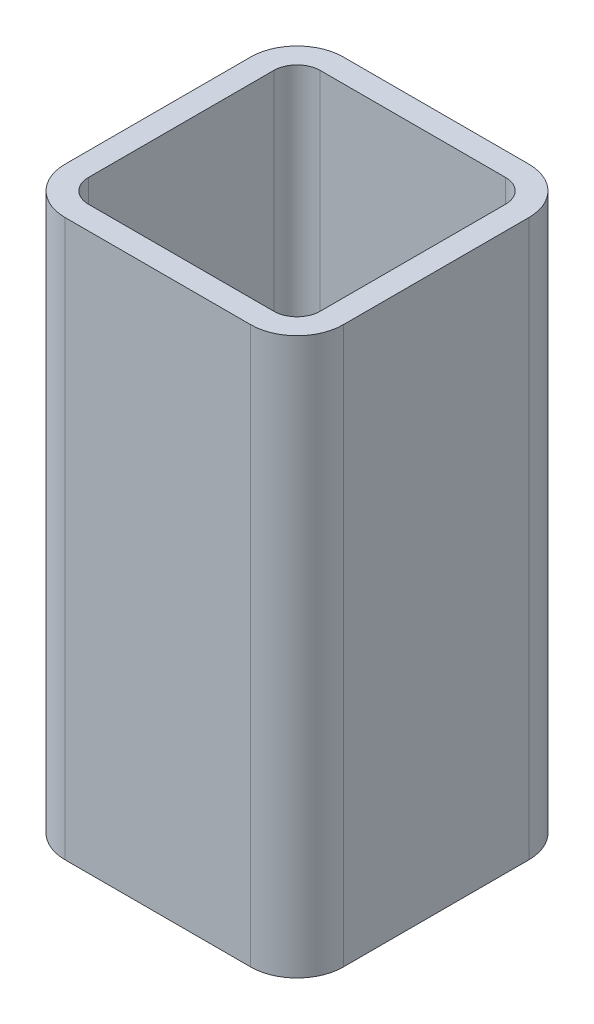
ISO-10303-21;
HEADER;
FILE_DESCRIPTION(('STEP AP214'),'2;1');
FILE_NAME('part.step','',(''),(''),'','','');
FILE_SCHEMA(('AUTOMOTIVE_DESIGN { 1 0 10303 214 1 1 1 1 }'));
ENDSEC;
DATA;
#1=APPLICATION_CONTEXT('core data for automotive mechanical design processes');
#2=APPLICATION_PROTOCOL_DEFINITION('international standard','automotive_design',2000,#1);
#3=PRODUCT_CONTEXT('',#1,'mechanical');
#4=PRODUCT('Part','Part','',(#3));
#5=PRODUCT_RELATED_PRODUCT_CATEGORY('part','',(#4));
#6=PRODUCT_DEFINITION_FORMATION('','',#4);
#7=PRODUCT_DEFINITION_CONTEXT('part definition',#1,'design');
#8=PRODUCT_DEFINITION('design','',#6,#7);
#9=PRODUCT_DEFINITION_SHAPE('','',#8);
#10=(LENGTH_UNIT() NAMED_UNIT(*) SI_UNIT(.MILLI.,.METRE.));
#11=(NAMED_UNIT(*) PLANE_ANGLE_UNIT() SI_UNIT($,.RADIAN.));
#12=(NAMED_UNIT(*) SI_UNIT($,.STERADIAN.) SOLID_ANGLE_UNIT());
#13=UNCERTAINTY_MEASURE_WITH_UNIT(LENGTH_MEASURE(1.E-05),#10,'distance_accuracy_value','');
#14=(GEOMETRIC_REPRESENTATION_CONTEXT(3) GLOBAL_UNCERTAINTY_ASSIGNED_CONTEXT((#13)) GLOBAL_UNIT_ASSIGNED_CONTEXT((#10,
#11,#12)) REPRESENTATION_CONTEXT('',''));
#15=CARTESIAN_POINT('',(0.,0.,0.));
#16=DIRECTION('',(0.,0.,1.));
#17=DIRECTION('',(1.,0.,0.));
#18=AXIS2_PLACEMENT_3D('',#15,#16,#17);
#19=CARTESIAN_POINT('',(50.8,152.4,-50.8));
#20=DIRECTION('',(0.,1.,0.));
#21=DIRECTION('',(0.,0.,1.));
#22=AXIS2_PLACEMENT_3D('',#19,#20,#21);
#23=PLANE('',#22);
#24=CARTESIAN_POINT('',(50.8,152.4,-50.8));
#25=DIRECTION('',(0.,1.,0.));
#26=DIRECTION('',(0.,0.,1.));
#27=AXIS2_PLACEMENT_3D('',#24,#25,#26);
#28=CIRCLE('',#27,25.4);
#29=CARTESIAN_POINT('',(76.2,152.4,-50.8));
#30=VERTEX_POINT('',#29);
#31=CARTESIAN_POINT('',(50.8,152.4,-76.2));
#32=VERTEX_POINT('',#31);
#33=EDGE_CURVE('E212',#30,#32,#28,.T.);
#34=ORIENTED_EDGE('',*,*,#33,.T.);
#35=DIRECTION('',(-1.,0.,0.));
#36=VECTOR('',#35,1.);
#37=CARTESIAN_POINT('',(50.8,152.4,-76.2));
#38=LINE('',#37,#36);
#39=CARTESIAN_POINT('',(-50.8,152.4,-76.2));
#40=VERTEX_POINT('',#39);
#41=EDGE_CURVE('E215',#32,#40,#38,.T.);
#42=ORIENTED_EDGE('',*,*,#41,.T.);
#43=CARTESIAN_POINT('',(-50.8,152.4,-50.8));
#44=DIRECTION('',(0.,1.,0.));
#45=DIRECTION('',(0.,0.,1.));
#46=AXIS2_PLACEMENT_3D('',#43,#44,#45);
#47=CIRCLE('',#46,25.4);
#48=CARTESIAN_POINT('',(-76.2,152.4,-50.8));
#49=VERTEX_POINT('',#48);
#50=EDGE_CURVE('E218',#40,#49,#47,.T.);
#51=ORIENTED_EDGE('',*,*,#50,.T.);
#52=DIRECTION('',(0.,0.,1.));
#53=VECTOR('',#52,1.);
#54=CARTESIAN_POINT('',(-76.2,152.4,50.8));
#55=LINE('',#54,#53);
#56=CARTESIAN_POINT('',(-76.2,152.4,50.8));
#57=VERTEX_POINT('',#56);
#58=EDGE_CURVE('E220',#49,#57,#55,.T.);
#59=ORIENTED_EDGE('',*,*,#58,.T.);
#60=CARTESIAN_POINT('',(-50.8,152.4,50.8));
#61=DIRECTION('',(0.,1.,0.));
#62=DIRECTION('',(0.,0.,1.));
#63=AXIS2_PLACEMENT_3D('',#60,#61,#62);
#64=CIRCLE('',#63,25.4);
#65=CARTESIAN_POINT('',(-50.8,152.4,76.2));
#66=VERTEX_POINT('',#65);
#67=EDGE_CURVE('E222',#57,#66,#64,.T.);
#68=ORIENTED_EDGE('',*,*,#67,.T.);
#69=DIRECTION('',(1.,0.,0.));
#70=VECTOR('',#69,1.);
#71=CARTESIAN_POINT('',(-50.8,152.4,76.2));
#72=LINE('',#71,#70);
#73=CARTESIAN_POINT('',(50.8,152.4,76.2));
#74=VERTEX_POINT('',#73);
#75=EDGE_CURVE('E224',#66,#74,#72,.T.);
#76=ORIENTED_EDGE('',*,*,#75,.T.);
#77=CARTESIAN_POINT('',(50.8,152.4,50.8));
#78=DIRECTION('',(0.,1.,0.));
#79=DIRECTION('',(0.,0.,1.));
#80=AXIS2_PLACEMENT_3D('',#77,#78,#79);
#81=CIRCLE('',#80,25.4);
#82=CARTESIAN_POINT('',(76.2,152.4,50.8));
#83=VERTEX_POINT('',#82);
#84=EDGE_CURVE('E226',#74,#83,#81,.T.);
#85=ORIENTED_EDGE('',*,*,#84,.T.);
#86=DIRECTION('',(0.,0.,-1.));
#87=VECTOR('',#86,1.);
#88=CARTESIAN_POINT('',(76.2,152.4,-50.8));
#89=LINE('',#88,#87);
#90=EDGE_CURVE('E228',#83,#30,#89,.T.);
#91=ORIENTED_EDGE('',*,*,#90,.T.);
#92=EDGE_LOOP('',(#34,#42,#51,#59,#68,#76,#85,#91));
#93=FACE_BOUND('',#92,.T.);
#94=DIRECTION('',(0.,0.,1.));
#95=VECTOR('',#94,1.);
#96=CARTESIAN_POINT('',(-63.5,152.4,50.8));
#97=LINE('',#96,#95);
#98=CARTESIAN_POINT('',(-63.5,152.4,-50.8));
#99=VERTEX_POINT('',#98);
#100=CARTESIAN_POINT('',(-63.5,152.4,50.8));
#101=VERTEX_POINT('',#100);
#102=EDGE_CURVE('E155',#99,#101,#97,.T.);
#103=ORIENTED_EDGE('',*,*,#102,.F.);
#104=CARTESIAN_POINT('',(-50.8,152.4,-50.8));
#105=DIRECTION('',(0.,1.,0.));
#106=DIRECTION('',(0.,0.,1.));
#107=AXIS2_PLACEMENT_3D('',#104,#105,#106);
#108=CIRCLE('',#107,12.7);
#109=CARTESIAN_POINT('',(-50.8,152.4,-63.4999999999999));
#110=VERTEX_POINT('',#109);
#111=EDGE_CURVE('E147',#110,#99,#108,.T.);
#112=ORIENTED_EDGE('',*,*,#111,.F.);
#113=DIRECTION('',(-1.,0.,0.));
#114=VECTOR('',#113,1.);
#115=CARTESIAN_POINT('',(50.8,152.4,-63.5));
#116=LINE('',#115,#114);
#117=CARTESIAN_POINT('',(50.8,152.4,-63.5));
#118=VERTEX_POINT('',#117);
#119=EDGE_CURVE('E180',#118,#110,#116,.T.);
#120=ORIENTED_EDGE('',*,*,#119,.F.);
#121=CARTESIAN_POINT('',(50.8,152.4,-50.8));
#122=DIRECTION('',(0.,1.,0.));
#123=DIRECTION('',(0.,0.,1.));
#124=AXIS2_PLACEMENT_3D('',#121,#122,#123);
#125=CIRCLE('',#124,12.7);
#126=CARTESIAN_POINT('',(63.4999999999999,152.4,-50.8));
#127=VERTEX_POINT('',#126);
#128=EDGE_CURVE('E178',#127,#118,#125,.T.);
#129=ORIENTED_EDGE('',*,*,#128,.F.);
#130=DIRECTION('',(0.,0.,-1.));
#131=VECTOR('',#130,1.);
#132=CARTESIAN_POINT('',(63.4999999999999,152.4,-50.8));
#133=LINE('',#132,#131);
#134=CARTESIAN_POINT('',(63.5,152.4,50.8));
#135=VERTEX_POINT('',#134);
#136=EDGE_CURVE('E176',#135,#127,#133,.T.);
#137=ORIENTED_EDGE('',*,*,#136,.F.);
#138=CARTESIAN_POINT('',(50.8,152.4,50.8));
#139=DIRECTION('',(0.,1.,0.));
#140=DIRECTION('',(0.,0.,1.));
#141=AXIS2_PLACEMENT_3D('',#138,#139,#140);
#142=CIRCLE('',#141,12.7);
#143=CARTESIAN_POINT('',(50.8,152.4,63.5));
#144=VERTEX_POINT('',#143);
#145=EDGE_CURVE('E174',#144,#135,#142,.T.);
#146=ORIENTED_EDGE('',*,*,#145,.F.);
#147=DIRECTION('',(1.,0.,0.));
#148=VECTOR('',#147,1.);
#149=CARTESIAN_POINT('',(-50.8,152.4,63.5));
#150=LINE('',#149,#148);
#151=CARTESIAN_POINT('',(-50.8,152.4,63.5));
#152=VERTEX_POINT('',#151);
#153=EDGE_CURVE('E170',#152,#144,#150,.T.);
#154=ORIENTED_EDGE('',*,*,#153,.F.);
#155=CARTESIAN_POINT('',(-50.8,152.4,50.8));
#156=DIRECTION('',(0.,1.,0.));
#157=DIRECTION('',(0.,0.,1.));
#158=AXIS2_PLACEMENT_3D('',#155,#156,#157);
#159=CIRCLE('',#158,12.7);
#160=EDGE_CURVE('E168',#101,#152,#159,.T.);
#161=ORIENTED_EDGE('',*,*,#160,.F.);
#162=EDGE_LOOP('',(#103,#112,#120,#129,#137,#146,#154,#161));
#163=FACE_BOUND('',#162,.T.);
#164=ADVANCED_FACE('F34',(#93,#163),#23,.T.);
#165=CARTESIAN_POINT('',(50.8,-152.4,-50.8));
#166=DIRECTION('',(0.,1.,0.));
#167=DIRECTION('',(0.,0.,1.));
#168=AXIS2_PLACEMENT_3D('',#165,#166,#167);
#169=PLANE('',#168);
#170=CARTESIAN_POINT('',(50.8,-152.4,-50.8));
#171=DIRECTION('',(0.,1.,0.));
#172=DIRECTION('',(0.,0.,1.));
#173=AXIS2_PLACEMENT_3D('',#170,#171,#172);
#174=CIRCLE('',#173,25.4);
#175=CARTESIAN_POINT('',(76.2,-152.4,-50.8));
#176=VERTEX_POINT('',#175);
#177=CARTESIAN_POINT('',(50.8,-152.4,-76.2));
#178=VERTEX_POINT('',#177);
#179=EDGE_CURVE('E163',#176,#178,#174,.T.);
#180=ORIENTED_EDGE('',*,*,#179,.F.);
#181=DIRECTION('',(0.,0.,-1.));
#182=VECTOR('',#181,1.);
#183=CARTESIAN_POINT('',(76.2,-152.4,-50.8));
#184=LINE('',#183,#182);
#185=CARTESIAN_POINT('',(76.2,-152.4,50.8));
#186=VERTEX_POINT('',#185);
#187=EDGE_CURVE('E216',#186,#176,#184,.T.);
#188=ORIENTED_EDGE('',*,*,#187,.F.);
#189=CARTESIAN_POINT('',(50.8,-152.4,50.8));
#190=DIRECTION('',(0.,1.,0.));
#191=DIRECTION('',(0.,0.,1.));
#192=AXIS2_PLACEMENT_3D('',#189,#190,#191);
#193=CIRCLE('',#192,25.4);
#194=CARTESIAN_POINT('',(50.8,-152.4,76.2));
#195=VERTEX_POINT('',#194);
#196=EDGE_CURVE('E243',#195,#186,#193,.T.);
#197=ORIENTED_EDGE('',*,*,#196,.F.);
#198=DIRECTION('',(1.,0.,0.));
#199=VECTOR('',#198,1.);
#200=CARTESIAN_POINT('',(-50.8,-152.4,76.2));
#201=LINE('',#200,#199);
#202=CARTESIAN_POINT('',(-50.8,-152.4,76.2));
#203=VERTEX_POINT('',#202);
#204=EDGE_CURVE('E241',#203,#195,#201,.T.);
#205=ORIENTED_EDGE('',*,*,#204,.F.);
#206=CARTESIAN_POINT('',(-50.8,-152.4,50.8));
#207=DIRECTION('',(0.,1.,0.));
#208=DIRECTION('',(0.,0.,1.));
#209=AXIS2_PLACEMENT_3D('',#206,#207,#208);
#210=CIRCLE('',#209,25.4);
#211=CARTESIAN_POINT('',(-76.2,-152.4,50.8));
#212=VERTEX_POINT('',#211);
#213=EDGE_CURVE('E239',#212,#203,#210,.T.);
#214=ORIENTED_EDGE('',*,*,#213,.F.);
#215=DIRECTION('',(0.,0.,1.));
#216=VECTOR('',#215,1.);
#217=CARTESIAN_POINT('',(-76.2,-152.4,50.8));
#218=LINE('',#217,#216);
#219=CARTESIAN_POINT('',(-76.2,-152.4,-50.8));
#220=VERTEX_POINT('',#219);
#221=EDGE_CURVE('E237',#220,#212,#218,.T.);
#222=ORIENTED_EDGE('',*,*,#221,.F.);
#223=CARTESIAN_POINT('',(-50.8,-152.4,-50.8));
#224=DIRECTION('',(0.,1.,0.));
#225=DIRECTION('',(0.,0.,1.));
#226=AXIS2_PLACEMENT_3D('',#223,#224,#225);
#227=CIRCLE('',#226,25.4);
#228=CARTESIAN_POINT('',(-50.8,-152.4,-76.2));
#229=VERTEX_POINT('',#228);
#230=EDGE_CURVE('E235',#229,#220,#227,.T.);
#231=ORIENTED_EDGE('',*,*,#230,.F.);
#232=DIRECTION('',(-1.,0.,0.));
#233=VECTOR('',#232,1.);
#234=CARTESIAN_POINT('',(50.8,-152.4,-76.2));
#235=LINE('',#234,#233);
#236=EDGE_CURVE('E233',#178,#229,#235,.T.);
#237=ORIENTED_EDGE('',*,*,#236,.F.);
#238=EDGE_LOOP('',(#180,#188,#197,#205,#214,#222,#231,#237));
#239=FACE_BOUND('',#238,.T.);
#240=CARTESIAN_POINT('',(-50.8,-152.4,-50.8));
#241=DIRECTION('',(0.,1.,0.));
#242=DIRECTION('',(0.,0.,1.));
#243=AXIS2_PLACEMENT_3D('',#240,#241,#242);
#244=CIRCLE('',#243,12.7);
#245=CARTESIAN_POINT('',(-50.8,-152.4,-63.4999999999999));
#246=VERTEX_POINT('',#245);
#247=CARTESIAN_POINT('',(-63.5,-152.4,-50.8));
#248=VERTEX_POINT('',#247);
#249=EDGE_CURVE('E57',#246,#248,#244,.T.);
#250=ORIENTED_EDGE('',*,*,#249,.T.);
#251=DIRECTION('',(0.,0.,1.));
#252=VECTOR('',#251,1.);
#253=CARTESIAN_POINT('',(-63.5,-152.4,50.8));
#254=LINE('',#253,#252);
#255=CARTESIAN_POINT('',(-63.5,-152.4,50.8));
#256=VERTEX_POINT('',#255);
#257=EDGE_CURVE('E162',#248,#256,#254,.T.);
#258=ORIENTED_EDGE('',*,*,#257,.T.);
#259=CARTESIAN_POINT('',(-50.8,-152.4,50.8));
#260=DIRECTION('',(0.,1.,0.));
#261=DIRECTION('',(0.,0.,1.));
#262=AXIS2_PLACEMENT_3D('',#259,#260,#261);
#263=CIRCLE('',#262,12.7);
#264=CARTESIAN_POINT('',(-50.8,-152.4,63.5));
#265=VERTEX_POINT('',#264);
#266=EDGE_CURVE('E184',#256,#265,#263,.T.);
#267=ORIENTED_EDGE('',*,*,#266,.T.);
#268=DIRECTION('',(1.,0.,0.));
#269=VECTOR('',#268,1.);
#270=CARTESIAN_POINT('',(-50.8,-152.4,63.5));
#271=LINE('',#270,#269);
#272=CARTESIAN_POINT('',(50.8,-152.4,63.5));
#273=VERTEX_POINT('',#272);
#274=EDGE_CURVE('E187',#265,#273,#271,.T.);
#275=ORIENTED_EDGE('',*,*,#274,.T.);
#276=CARTESIAN_POINT('',(50.8,-152.4,50.8));
#277=DIRECTION('',(0.,1.,0.));
#278=DIRECTION('',(0.,0.,1.));
#279=AXIS2_PLACEMENT_3D('',#276,#277,#278);
#280=CIRCLE('',#279,12.7);
#281=CARTESIAN_POINT('',(63.5,-152.4,50.8));
#282=VERTEX_POINT('',#281);
#283=EDGE_CURVE('E190',#273,#282,#280,.T.);
#284=ORIENTED_EDGE('',*,*,#283,.T.);
#285=DIRECTION('',(0.,0.,-1.));
#286=VECTOR('',#285,1.);
#287=CARTESIAN_POINT('',(63.4999999999999,-152.4,-50.8));
#288=LINE('',#287,#286);
#289=CARTESIAN_POINT('',(63.4999999999999,-152.4,-50.8));
#290=VERTEX_POINT('',#289);
#291=EDGE_CURVE('E193',#282,#290,#288,.T.);
#292=ORIENTED_EDGE('',*,*,#291,.T.);
#293=CARTESIAN_POINT('',(50.8,-152.4,-50.8));
#294=DIRECTION('',(0.,1.,0.));
#295=DIRECTION('',(0.,0.,1.));
#296=AXIS2_PLACEMENT_3D('',#293,#294,#295);
#297=CIRCLE('',#296,12.7);
#298=CARTESIAN_POINT('',(50.8,-152.4,-63.5));
#299=VERTEX_POINT('',#298);
#300=EDGE_CURVE('E196',#290,#299,#297,.T.);
#301=ORIENTED_EDGE('',*,*,#300,.T.);
#302=DIRECTION('',(-1.,0.,0.));
#303=VECTOR('',#302,1.);
#304=CARTESIAN_POINT('',(50.8,-152.4,-63.5));
#305=LINE('',#304,#303);
#306=EDGE_CURVE('E156',#299,#246,#305,.T.);
#307=ORIENTED_EDGE('',*,*,#306,.T.);
#308=EDGE_LOOP('',(#250,#258,#267,#275,#284,#292,#301,#307));
#309=FACE_BOUND('',#308,.T.);
#310=ADVANCED_FACE('F273',(#239,#309),#169,.F.);
#311=CARTESIAN_POINT('',(50.8,152.4,-50.8));
#312=DIRECTION('',(0.,-1.,0.));
#313=DIRECTION('',(0.,0.,-1.));
#314=AXIS2_PLACEMENT_3D('',#311,#312,#313);
#315=CYLINDRICAL_SURFACE('',#314,25.4);
#316=ORIENTED_EDGE('',*,*,#179,.T.);
#317=DIRECTION('',(0.,-1.,0.));
#318=VECTOR('',#317,1.);
#319=CARTESIAN_POINT('',(50.8,152.4,-76.2));
#320=LINE('',#319,#318);
#321=EDGE_CURVE('E11',#32,#178,#320,.T.);
#322=ORIENTED_EDGE('',*,*,#321,.F.);
#323=ORIENTED_EDGE('',*,*,#33,.F.);
#324=DIRECTION('',(0.,-1.,0.));
#325=VECTOR('',#324,1.);
#326=CARTESIAN_POINT('',(76.2,152.4,-50.8));
#327=LINE('',#326,#325);
#328=EDGE_CURVE('E230',#30,#176,#327,.T.);
#329=ORIENTED_EDGE('',*,*,#328,.T.);
#330=EDGE_LOOP('',(#316,#322,#323,#329));
#331=FACE_BOUND('',#330,.T.);
#332=ADVANCED_FACE('F36',(#331),#315,.T.);
#333=CARTESIAN_POINT('',(50.8,152.4,-76.2));
#334=DIRECTION('',(0.,0.,1.));
#335=DIRECTION('',(1.,0.,0.));
#336=AXIS2_PLACEMENT_3D('',#333,#334,#335);
#337=PLANE('',#336);
#338=ORIENTED_EDGE('',*,*,#236,.T.);
#339=DIRECTION('',(0.,-1.,0.));
#340=VECTOR('',#339,1.);
#341=CARTESIAN_POINT('',(-50.8,152.4,-76.2));
#342=LINE('',#341,#340);
#343=EDGE_CURVE('E42',#40,#229,#342,.T.);
#344=ORIENTED_EDGE('',*,*,#343,.F.);
#345=ORIENTED_EDGE('',*,*,#41,.F.);
#346=ORIENTED_EDGE('',*,*,#321,.T.);
#347=EDGE_LOOP('',(#338,#344,#345,#346));
#348=FACE_BOUND('',#347,.T.);
#349=ADVANCED_FACE('F290',(#348),#337,.F.);
#350=CARTESIAN_POINT('',(-50.8,152.4,-50.8));
#351=DIRECTION('',(0.,-1.,0.));
#352=DIRECTION('',(0.,0.,-1.));
#353=AXIS2_PLACEMENT_3D('',#350,#351,#352);
#354=CYLINDRICAL_SURFACE('',#353,25.4);
#355=ORIENTED_EDGE('',*,*,#230,.T.);
#356=DIRECTION('',(0.,-1.,0.));
#357=VECTOR('',#356,1.);
#358=CARTESIAN_POINT('',(-76.2,152.4,-50.8));
#359=LINE('',#358,#357);
#360=EDGE_CURVE('E260',#49,#220,#359,.T.);
#361=ORIENTED_EDGE('',*,*,#360,.F.);
#362=ORIENTED_EDGE('',*,*,#50,.F.);
#363=ORIENTED_EDGE('',*,*,#343,.T.);
#364=EDGE_LOOP('',(#355,#361,#362,#363));
#365=FACE_BOUND('',#364,.T.);
#366=ADVANCED_FACE('F267',(#365),#354,.T.);
#367=CARTESIAN_POINT('',(-76.2,152.4,50.8));
#368=DIRECTION('',(1.,0.,0.));
#369=DIRECTION('',(0.,0.,-1.));
#370=AXIS2_PLACEMENT_3D('',#367,#368,#369);
#371=PLANE('',#370);
#372=ORIENTED_EDGE('',*,*,#221,.T.);
#373=DIRECTION('',(0.,-1.,0.));
#374=VECTOR('',#373,1.);
#375=CARTESIAN_POINT('',(-76.2,152.4,50.8));
#376=LINE('',#375,#374);
#377=EDGE_CURVE('E257',#57,#212,#376,.T.);
#378=ORIENTED_EDGE('',*,*,#377,.F.);
#379=ORIENTED_EDGE('',*,*,#58,.F.);
#380=ORIENTED_EDGE('',*,*,#360,.T.);
#381=EDGE_LOOP('',(#372,#378,#379,#380));
#382=FACE_BOUND('',#381,.T.);
#383=ADVANCED_FACE('F279',(#382),#371,.F.);
#384=CARTESIAN_POINT('',(-50.8,152.4,50.8));
#385=DIRECTION('',(0.,-1.,0.));
#386=DIRECTION('',(0.,0.,-1.));
#387=AXIS2_PLACEMENT_3D('',#384,#385,#386);
#388=CYLINDRICAL_SURFACE('',#387,25.4);
#389=ORIENTED_EDGE('',*,*,#213,.T.);
#390=DIRECTION('',(0.,-1.,0.));
#391=VECTOR('',#390,1.);
#392=CARTESIAN_POINT('',(-50.8,152.4,76.2));
#393=LINE('',#392,#391);
#394=EDGE_CURVE('E254',#66,#203,#393,.T.);
#395=ORIENTED_EDGE('',*,*,#394,.F.);
#396=ORIENTED_EDGE('',*,*,#67,.F.);
#397=ORIENTED_EDGE('',*,*,#377,.T.);
#398=EDGE_LOOP('',(#389,#395,#396,#397));
#399=FACE_BOUND('',#398,.T.);
#400=ADVANCED_FACE('F283',(#399),#388,.T.);
#401=CARTESIAN_POINT('',(-50.8,152.4,76.2));
#402=DIRECTION('',(0.,0.,-1.));
#403=DIRECTION('',(-1.,0.,0.));
#404=AXIS2_PLACEMENT_3D('',#401,#402,#403);
#405=PLANE('',#404);
#406=ORIENTED_EDGE('',*,*,#204,.T.);
#407=DIRECTION('',(0.,-1.,0.));
#408=VECTOR('',#407,1.);
#409=CARTESIAN_POINT('',(50.8,152.4,76.2));
#410=LINE('',#409,#408);
#411=EDGE_CURVE('E251',#74,#195,#410,.T.);
#412=ORIENTED_EDGE('',*,*,#411,.F.);
#413=ORIENTED_EDGE('',*,*,#75,.F.);
#414=ORIENTED_EDGE('',*,*,#394,.T.);
#415=EDGE_LOOP('',(#406,#412,#413,#414));
#416=FACE_BOUND('',#415,.T.);
#417=ADVANCED_FACE('F303',(#416),#405,.F.);
#418=CARTESIAN_POINT('',(50.8,152.4,50.8));
#419=DIRECTION('',(0.,-1.,0.));
#420=DIRECTION('',(0.,0.,-1.));
#421=AXIS2_PLACEMENT_3D('',#418,#419,#420);
#422=CYLINDRICAL_SURFACE('',#421,25.4);
#423=ORIENTED_EDGE('',*,*,#196,.T.);
#424=DIRECTION('',(0.,-1.,0.));
#425=VECTOR('',#424,1.);
#426=CARTESIAN_POINT('',(76.2,152.4,50.8));
#427=LINE('',#426,#425);
#428=EDGE_CURVE('E248',#83,#186,#427,.T.);
#429=ORIENTED_EDGE('',*,*,#428,.F.);
#430=ORIENTED_EDGE('',*,*,#84,.F.);
#431=ORIENTED_EDGE('',*,*,#411,.T.);
#432=EDGE_LOOP('',(#423,#429,#430,#431));
#433=FACE_BOUND('',#432,.T.);
#434=ADVANCED_FACE('F301',(#433),#422,.T.);
#435=CARTESIAN_POINT('',(76.2,152.4,-50.8));
#436=DIRECTION('',(-1.,0.,0.));
#437=DIRECTION('',(0.,0.,1.));
#438=AXIS2_PLACEMENT_3D('',#435,#436,#437);
#439=PLANE('',#438);
#440=ORIENTED_EDGE('',*,*,#187,.T.);
#441=ORIENTED_EDGE('',*,*,#328,.F.);
#442=ORIENTED_EDGE('',*,*,#90,.F.);
#443=ORIENTED_EDGE('',*,*,#428,.T.);
#444=EDGE_LOOP('',(#440,#441,#442,#443));
#445=FACE_BOUND('',#444,.T.);
#446=ADVANCED_FACE('F296',(#445),#439,.F.);
#447=CARTESIAN_POINT('',(-50.8,152.4,-50.8));
#448=DIRECTION('',(0.,-1.,0.));
#449=DIRECTION('',(0.,0.,-1.));
#450=AXIS2_PLACEMENT_3D('',#447,#448,#449);
#451=CYLINDRICAL_SURFACE('',#450,12.7);
#452=ORIENTED_EDGE('',*,*,#249,.F.);
#453=DIRECTION('',(0.,-1.,0.));
#454=VECTOR('',#453,1.);
#455=CARTESIAN_POINT('',(-50.8,152.4,-63.4999999999999));
#456=LINE('',#455,#454);
#457=EDGE_CURVE('E151',#110,#246,#456,.T.);
#458=ORIENTED_EDGE('',*,*,#457,.F.);
#459=ORIENTED_EDGE('',*,*,#111,.T.);
#460=DIRECTION('',(0.,-1.,0.));
#461=VECTOR('',#460,1.);
#462=CARTESIAN_POINT('',(-63.5,152.4,-50.8));
#463=LINE('',#462,#461);
#464=EDGE_CURVE('E150',#99,#248,#463,.T.);
#465=ORIENTED_EDGE('',*,*,#464,.T.);
#466=EDGE_LOOP('',(#452,#458,#459,#465));
#467=FACE_BOUND('',#466,.T.);
#468=ADVANCED_FACE('F149',(#467),#451,.F.);
#469=CARTESIAN_POINT('',(-63.5,152.4,50.8));
#470=DIRECTION('',(1.,0.,0.));
#471=DIRECTION('',(0.,0.,-1.));
#472=AXIS2_PLACEMENT_3D('',#469,#470,#471);
#473=PLANE('',#472);
#474=ORIENTED_EDGE('',*,*,#257,.F.);
#475=ORIENTED_EDGE('',*,*,#464,.F.);
#476=ORIENTED_EDGE('',*,*,#102,.T.);
#477=DIRECTION('',(0.,-1.,0.));
#478=VECTOR('',#477,1.);
#479=CARTESIAN_POINT('',(-63.5,152.4,50.8));
#480=LINE('',#479,#478);
#481=EDGE_CURVE('E164',#101,#256,#480,.T.);
#482=ORIENTED_EDGE('',*,*,#481,.T.);
#483=EDGE_LOOP('',(#474,#475,#476,#482));
#484=FACE_BOUND('',#483,.T.);
#485=ADVANCED_FACE('F159',(#484),#473,.T.);
#486=CARTESIAN_POINT('',(-50.8,152.4,50.8));
#487=DIRECTION('',(0.,-1.,0.));
#488=DIRECTION('',(0.,0.,-1.));
#489=AXIS2_PLACEMENT_3D('',#486,#487,#488);
#490=CYLINDRICAL_SURFACE('',#489,12.7);
#491=ORIENTED_EDGE('',*,*,#266,.F.);
#492=ORIENTED_EDGE('',*,*,#481,.F.);
#493=ORIENTED_EDGE('',*,*,#160,.T.);
#494=DIRECTION('',(0.,-1.,0.));
#495=VECTOR('',#494,1.);
#496=CARTESIAN_POINT('',(-50.8,152.4,63.5));
#497=LINE('',#496,#495);
#498=EDGE_CURVE('E209',#152,#265,#497,.T.);
#499=ORIENTED_EDGE('',*,*,#498,.T.);
#500=EDGE_LOOP('',(#491,#492,#493,#499));
#501=FACE_BOUND('',#500,.T.);
#502=ADVANCED_FACE('F328',(#501),#490,.F.);
#503=CARTESIAN_POINT('',(-50.8,152.4,63.5));
#504=DIRECTION('',(0.,0.,-1.));
#505=DIRECTION('',(-1.,0.,0.));
#506=AXIS2_PLACEMENT_3D('',#503,#504,#505);
#507=PLANE('',#506);
#508=ORIENTED_EDGE('',*,*,#274,.F.);
#509=ORIENTED_EDGE('',*,*,#498,.F.);
#510=ORIENTED_EDGE('',*,*,#153,.T.);
#511=DIRECTION('',(0.,-1.,0.));
#512=VECTOR('',#511,1.);
#513=CARTESIAN_POINT('',(50.8,152.4,63.5));
#514=LINE('',#513,#512);
#515=EDGE_CURVE('E207',#144,#273,#514,.T.);
#516=ORIENTED_EDGE('',*,*,#515,.T.);
#517=EDGE_LOOP('',(#508,#509,#510,#516));
#518=FACE_BOUND('',#517,.T.);
#519=ADVANCED_FACE('F332',(#518),#507,.T.);
#520=CARTESIAN_POINT('',(50.8,152.4,50.8));
#521=DIRECTION('',(0.,-1.,0.));
#522=DIRECTION('',(0.,0.,-1.));
#523=AXIS2_PLACEMENT_3D('',#520,#521,#522);
#524=CYLINDRICAL_SURFACE('',#523,12.7);
#525=ORIENTED_EDGE('',*,*,#283,.F.);
#526=ORIENTED_EDGE('',*,*,#515,.F.);
#527=ORIENTED_EDGE('',*,*,#145,.T.);
#528=DIRECTION('',(0.,-1.,0.));
#529=VECTOR('',#528,1.);
#530=CARTESIAN_POINT('',(63.5,152.4,50.8));
#531=LINE('',#530,#529);
#532=EDGE_CURVE('E205',#135,#282,#531,.T.);
#533=ORIENTED_EDGE('',*,*,#532,.T.);
#534=EDGE_LOOP('',(#525,#526,#527,#533));
#535=FACE_BOUND('',#534,.T.);
#536=ADVANCED_FACE('F338',(#535),#524,.F.);
#537=CARTESIAN_POINT('',(63.4999999999999,152.4,-50.8));
#538=DIRECTION('',(-1.,0.,0.));
#539=DIRECTION('',(0.,0.,1.));
#540=AXIS2_PLACEMENT_3D('',#537,#538,#539);
#541=PLANE('',#540);
#542=ORIENTED_EDGE('',*,*,#291,.F.);
#543=ORIENTED_EDGE('',*,*,#532,.F.);
#544=ORIENTED_EDGE('',*,*,#136,.T.);
#545=DIRECTION('',(0.,-1.,0.));
#546=VECTOR('',#545,1.);
#547=CARTESIAN_POINT('',(63.4999999999999,152.4,-50.8));
#548=LINE('',#547,#546);
#549=EDGE_CURVE('E203',#127,#290,#548,.T.);
#550=ORIENTED_EDGE('',*,*,#549,.T.);
#551=EDGE_LOOP('',(#542,#543,#544,#550));
#552=FACE_BOUND('',#551,.T.);
#553=ADVANCED_FACE('F342',(#552),#541,.T.);
#554=CARTESIAN_POINT('',(50.8,152.4,-50.8));
#555=DIRECTION('',(0.,-1.,0.));
#556=DIRECTION('',(0.,0.,-1.));
#557=AXIS2_PLACEMENT_3D('',#554,#555,#556);
#558=CYLINDRICAL_SURFACE('',#557,12.7);
#559=ORIENTED_EDGE('',*,*,#300,.F.);
#560=ORIENTED_EDGE('',*,*,#549,.F.);
#561=ORIENTED_EDGE('',*,*,#128,.T.);
#562=DIRECTION('',(0.,-1.,0.));
#563=VECTOR('',#562,1.);
#564=CARTESIAN_POINT('',(50.8,152.4,-63.5));
#565=LINE('',#564,#563);
#566=EDGE_CURVE('E49',#118,#299,#565,.T.);
#567=ORIENTED_EDGE('',*,*,#566,.T.);
#568=EDGE_LOOP('',(#559,#560,#561,#567));
#569=FACE_BOUND('',#568,.T.);
#570=ADVANCED_FACE('F346',(#569),#558,.F.);
#571=CARTESIAN_POINT('',(50.8,152.4,-63.5));
#572=DIRECTION('',(0.,0.,1.));
#573=DIRECTION('',(1.,0.,0.));
#574=AXIS2_PLACEMENT_3D('',#571,#572,#573);
#575=PLANE('',#574);
#576=ORIENTED_EDGE('',*,*,#306,.F.);
#577=ORIENTED_EDGE('',*,*,#566,.F.);
#578=ORIENTED_EDGE('',*,*,#119,.T.);
#579=ORIENTED_EDGE('',*,*,#457,.T.);
#580=EDGE_LOOP('',(#576,#577,#578,#579));
#581=FACE_BOUND('',#580,.T.);
#582=ADVANCED_FACE('F350',(#581),#575,.T.);
#583=CLOSED_SHELL('',(#164,#310,#332,#349,#366,#383,#400,#417,#434,#446,#468,#485,#502,#519,
#536,#553,#570,#582));
#584=MANIFOLD_SOLID_BREP('B2',#583);
#585=ADVANCED_BREP_SHAPE_REPRESENTATION('',(#18,#584),#14);
#586=SHAPE_DEFINITION_REPRESENTATION(#9,#585);
ENDSEC;
END-ISO-10303-21;
